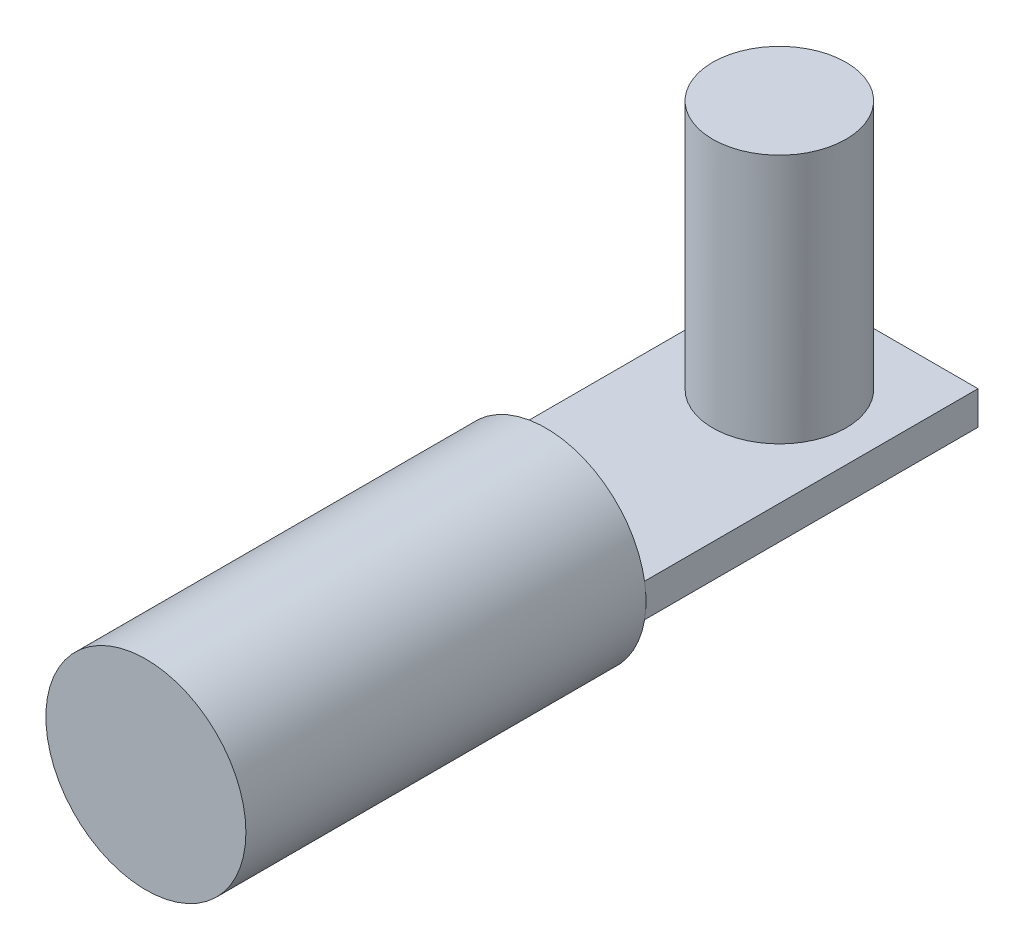
ISO-10303-21;
HEADER;
FILE_DESCRIPTION(('STEP AP214'),'2;1');
FILE_NAME('part.step','',(''),(''),'','','');
FILE_SCHEMA(('AUTOMOTIVE_DESIGN { 1 0 10303 214 1 1 1 1 }'));
ENDSEC;
DATA;
#1=APPLICATION_CONTEXT('core data for automotive mechanical design processes');
#2=APPLICATION_PROTOCOL_DEFINITION('international standard','automotive_design',2000,#1);
#3=PRODUCT_CONTEXT('',#1,'mechanical');
#4=PRODUCT('Part','Part','',(#3));
#5=PRODUCT_RELATED_PRODUCT_CATEGORY('part','',(#4));
#6=PRODUCT_DEFINITION_FORMATION('','',#4);
#7=PRODUCT_DEFINITION_CONTEXT('part definition',#1,'design');
#8=PRODUCT_DEFINITION('design','',#6,#7);
#9=PRODUCT_DEFINITION_SHAPE('','',#8);
#10=(LENGTH_UNIT() NAMED_UNIT(*) SI_UNIT(.MILLI.,.METRE.));
#11=(NAMED_UNIT(*) PLANE_ANGLE_UNIT() SI_UNIT($,.RADIAN.));
#12=(NAMED_UNIT(*) SI_UNIT($,.STERADIAN.) SOLID_ANGLE_UNIT());
#13=UNCERTAINTY_MEASURE_WITH_UNIT(LENGTH_MEASURE(1.E-05),#10,'distance_accuracy_value','');
#14=(GEOMETRIC_REPRESENTATION_CONTEXT(3) GLOBAL_UNCERTAINTY_ASSIGNED_CONTEXT((#13)) GLOBAL_UNIT_ASSIGNED_CONTEXT((#10,
#11,#12)) REPRESENTATION_CONTEXT('',''));
#15=CARTESIAN_POINT('',(0.,0.,0.));
#16=DIRECTION('',(0.,0.,1.));
#17=DIRECTION('',(1.,0.,0.));
#18=AXIS2_PLACEMENT_3D('',#15,#16,#17);
#19=CARTESIAN_POINT('',(0.,0.,0.));
#20=DIRECTION('',(0.,0.,1.));
#21=DIRECTION('',(1.,0.,0.));
#22=AXIS2_PLACEMENT_3D('',#19,#20,#21);
#23=PLANE('',#22);
#24=DIRECTION('',(0.,1.,0.));
#25=VECTOR('',#24,1.);
#26=CARTESIAN_POINT('',(-2.95782724043532,-0.501256437104602,0.));
#27=LINE('',#26,#25);
#28=CARTESIAN_POINT('',(-2.95782724043532,-0.501256437104602,0.));
#29=VERTEX_POINT('',#28);
#30=CARTESIAN_POINT('',(-2.95782724043532,0.501256437104602,0.));
#31=VERTEX_POINT('',#30);
#32=EDGE_CURVE('E55',#29,#31,#27,.T.);
#33=ORIENTED_EDGE('',*,*,#32,.F.);
#34=CARTESIAN_POINT('',(0.,0.,0.));
#35=DIRECTION('',(0.,0.,1.));
#36=DIRECTION('',(1.,0.,0.));
#37=AXIS2_PLACEMENT_3D('',#34,#35,#36);
#38=CIRCLE('',#37,3.);
#39=EDGE_CURVE('E109',#31,#29,#38,.T.);
#40=ORIENTED_EDGE('',*,*,#39,.F.);
#41=EDGE_LOOP('',(#33,#40));
#42=FACE_BOUND('',#41,.T.);
#43=ADVANCED_FACE('F34',(#42),#23,.F.);
#44=DIRECTION('',(-1.,0.,0.));
#45=VECTOR('',#44,1.);
#46=CARTESIAN_POINT('',(2.95782724043532,-0.501256437104602,0.));
#47=LINE('',#46,#45);
#48=CARTESIAN_POINT('',(2.95782724043532,-0.501256437104602,0.));
#49=VERTEX_POINT('',#48);
#50=EDGE_CURVE('E48',#49,#29,#47,.T.);
#51=ORIENTED_EDGE('',*,*,#50,.F.);
#52=EDGE_CURVE('E101',#29,#49,#38,.T.);
#53=ORIENTED_EDGE('',*,*,#52,.F.);
#54=EDGE_LOOP('',(#51,#53));
#55=FACE_BOUND('',#54,.T.);
#56=ADVANCED_FACE('F155',(#55),#23,.F.);
#57=DIRECTION('',(0.,-1.,0.));
#58=VECTOR('',#57,1.);
#59=CARTESIAN_POINT('',(2.95782724043532,-0.501256437104602,0.));
#60=LINE('',#59,#58);
#61=CARTESIAN_POINT('',(2.95782724043532,0.501256437104602,0.));
#62=VERTEX_POINT('',#61);
#63=EDGE_CURVE('E117',#62,#49,#60,.T.);
#64=ORIENTED_EDGE('',*,*,#63,.F.);
#65=EDGE_CURVE('E98',#49,#62,#38,.T.);
#66=ORIENTED_EDGE('',*,*,#65,.F.);
#67=EDGE_LOOP('',(#64,#66));
#68=FACE_BOUND('',#67,.T.);
#69=ADVANCED_FACE('F160',(#68),#23,.F.);
#70=DIRECTION('',(1.,0.,0.));
#71=VECTOR('',#70,1.);
#72=CARTESIAN_POINT('',(2.95782724043532,0.501256437104602,0.));
#73=LINE('',#72,#71);
#74=EDGE_CURVE('E121',#31,#62,#73,.T.);
#75=ORIENTED_EDGE('',*,*,#74,.F.);
#76=EDGE_CURVE('E102',#62,#31,#38,.T.);
#77=ORIENTED_EDGE('',*,*,#76,.F.);
#78=EDGE_LOOP('',(#75,#77));
#79=FACE_BOUND('',#78,.T.);
#80=ADVANCED_FACE('F156',(#79),#23,.F.);
#81=CARTESIAN_POINT('',(0.,0.,12.));
#82=DIRECTION('',(0.,0.,-1.));
#83=DIRECTION('',(-1.,0.,0.));
#84=AXIS2_PLACEMENT_3D('',#81,#82,#83);
#85=CYLINDRICAL_SURFACE('',#84,3.);
#86=CARTESIAN_POINT('',(0.,0.,12.));
#87=DIRECTION('',(0.,0.,1.));
#88=DIRECTION('',(1.,0.,0.));
#89=AXIS2_PLACEMENT_3D('',#86,#87,#88);
#90=CIRCLE('',#89,3.);
#91=CARTESIAN_POINT('',(3.,0.,12.));
#92=VERTEX_POINT('',#91);
#93=EDGE_CURVE('E42',#92,#92,#90,.T.);
#94=ORIENTED_EDGE('',*,*,#93,.F.);
#95=EDGE_LOOP('',(#94));
#96=FACE_BOUND('',#95,.T.);
#97=ORIENTED_EDGE('',*,*,#76,.T.);
#98=ORIENTED_EDGE('',*,*,#39,.T.);
#99=ORIENTED_EDGE('',*,*,#52,.T.);
#100=ORIENTED_EDGE('',*,*,#65,.T.);
#101=EDGE_LOOP('',(#97,#98,#99,#100));
#102=FACE_BOUND('',#101,.T.);
#103=ADVANCED_FACE('F36',(#96,#102),#85,.T.);
#104=CARTESIAN_POINT('',(0.,0.,12.));
#105=DIRECTION('',(0.,0.,1.));
#106=DIRECTION('',(1.,0.,0.));
#107=AXIS2_PLACEMENT_3D('',#104,#105,#106);
#108=PLANE('',#107);
#109=ORIENTED_EDGE('',*,*,#93,.T.);
#110=EDGE_LOOP('',(#109));
#111=FACE_BOUND('',#110,.T.);
#112=ADVANCED_FACE('F152',(#111),#108,.T.);
#113=CARTESIAN_POINT('',(-2.95782724043532,-0.501256437104602,-10.));
#114=DIRECTION('',(1.,0.,0.));
#115=DIRECTION('',(0.,0.,-1.));
#116=AXIS2_PLACEMENT_3D('',#113,#114,#115);
#117=PLANE('',#116);
#118=ORIENTED_EDGE('',*,*,#32,.T.);
#119=DIRECTION('',(0.,0.,1.));
#120=VECTOR('',#119,1.);
#121=CARTESIAN_POINT('',(-2.95782724043532,0.501256437104602,-10.));
#122=LINE('',#121,#120);
#123=CARTESIAN_POINT('',(-2.95782724043532,0.501256437104602,-10.));
#124=VERTEX_POINT('',#123);
#125=EDGE_CURVE('E81',#124,#31,#122,.T.);
#126=ORIENTED_EDGE('',*,*,#125,.F.);
#127=DIRECTION('',(0.,1.,0.));
#128=VECTOR('',#127,1.);
#129=CARTESIAN_POINT('',(-2.95782724043532,-0.501256437104602,-10.));
#130=LINE('',#129,#128);
#131=CARTESIAN_POINT('',(-2.95782724043532,-0.501256437104602,-10.));
#132=VERTEX_POINT('',#131);
#133=EDGE_CURVE('E87',#132,#124,#130,.T.);
#134=ORIENTED_EDGE('',*,*,#133,.F.);
#135=DIRECTION('',(0.,0.,1.));
#136=VECTOR('',#135,1.);
#137=CARTESIAN_POINT('',(-2.95782724043532,-0.501256437104602,-10.));
#138=LINE('',#137,#136);
#139=EDGE_CURVE('E125',#132,#29,#138,.T.);
#140=ORIENTED_EDGE('',*,*,#139,.T.);
#141=EDGE_LOOP('',(#118,#126,#134,#140));
#142=FACE_BOUND('',#141,.T.);
#143=ADVANCED_FACE('F97',(#142),#117,.F.);
#144=CARTESIAN_POINT('',(2.95782724043532,0.501256437104602,-10.));
#145=DIRECTION('',(0.,-1.,0.));
#146=DIRECTION('',(0.,0.,-1.));
#147=AXIS2_PLACEMENT_3D('',#144,#145,#146);
#148=PLANE('',#147);
#149=CARTESIAN_POINT('',(0.,0.501256437104602,-7.));
#150=DIRECTION('',(0.,-1.,0.));
#151=DIRECTION('',(0.,0.,-1.));
#152=AXIS2_PLACEMENT_3D('',#149,#150,#151);
#153=CIRCLE('',#152,2.);
#154=CARTESIAN_POINT('',(0.,0.501256437104602,-9.));
#155=VERTEX_POINT('',#154);
#156=EDGE_CURVE('E11',#155,#155,#153,.F.);
#157=ORIENTED_EDGE('',*,*,#156,.F.);
#158=EDGE_LOOP('',(#157));
#159=FACE_BOUND('',#158,.T.);
#160=ORIENTED_EDGE('',*,*,#74,.T.);
#161=DIRECTION('',(0.,0.,1.));
#162=VECTOR('',#161,1.);
#163=CARTESIAN_POINT('',(2.95782724043532,0.501256437104602,-10.));
#164=LINE('',#163,#162);
#165=CARTESIAN_POINT('',(2.95782724043532,0.501256437104602,-10.));
#166=VERTEX_POINT('',#165);
#167=EDGE_CURVE('E83',#166,#62,#164,.T.);
#168=ORIENTED_EDGE('',*,*,#167,.F.);
#169=DIRECTION('',(1.,0.,0.));
#170=VECTOR('',#169,1.);
#171=CARTESIAN_POINT('',(2.95782724043532,0.501256437104602,-10.));
#172=LINE('',#171,#170);
#173=EDGE_CURVE('E76',#124,#166,#172,.T.);
#174=ORIENTED_EDGE('',*,*,#173,.F.);
#175=ORIENTED_EDGE('',*,*,#125,.T.);
#176=EDGE_LOOP('',(#160,#168,#174,#175));
#177=FACE_BOUND('',#176,.T.);
#178=ADVANCED_FACE('F79',(#159,#177),#148,.F.);
#179=CARTESIAN_POINT('',(2.95782724043532,-0.501256437104602,-10.));
#180=DIRECTION('',(-1.,0.,0.));
#181=DIRECTION('',(0.,0.,1.));
#182=AXIS2_PLACEMENT_3D('',#179,#180,#181);
#183=PLANE('',#182);
#184=ORIENTED_EDGE('',*,*,#63,.T.);
#185=DIRECTION('',(0.,0.,1.));
#186=VECTOR('',#185,1.);
#187=CARTESIAN_POINT('',(2.95782724043532,-0.501256437104602,-10.));
#188=LINE('',#187,#186);
#189=CARTESIAN_POINT('',(2.95782724043532,-0.501256437104602,-10.));
#190=VERTEX_POINT('',#189);
#191=EDGE_CURVE('E103',#190,#49,#188,.T.);
#192=ORIENTED_EDGE('',*,*,#191,.F.);
#193=DIRECTION('',(0.,-1.,0.));
#194=VECTOR('',#193,1.);
#195=CARTESIAN_POINT('',(2.95782724043532,-0.501256437104602,-10.));
#196=LINE('',#195,#194);
#197=EDGE_CURVE('E86',#166,#190,#196,.T.);
#198=ORIENTED_EDGE('',*,*,#197,.F.);
#199=ORIENTED_EDGE('',*,*,#167,.T.);
#200=EDGE_LOOP('',(#184,#192,#198,#199));
#201=FACE_BOUND('',#200,.T.);
#202=ADVANCED_FACE('F119',(#201),#183,.F.);
#203=CARTESIAN_POINT('',(2.95782724043532,-0.501256437104602,-10.));
#204=DIRECTION('',(0.,1.,0.));
#205=DIRECTION('',(0.,0.,1.));
#206=AXIS2_PLACEMENT_3D('',#203,#204,#205);
#207=PLANE('',#206);
#208=ORIENTED_EDGE('',*,*,#50,.T.);
#209=ORIENTED_EDGE('',*,*,#139,.F.);
#210=DIRECTION('',(-1.,0.,0.));
#211=VECTOR('',#210,1.);
#212=CARTESIAN_POINT('',(2.95782724043532,-0.501256437104602,-10.));
#213=LINE('',#212,#211);
#214=EDGE_CURVE('E92',#190,#132,#213,.T.);
#215=ORIENTED_EDGE('',*,*,#214,.F.);
#216=ORIENTED_EDGE('',*,*,#191,.T.);
#217=EDGE_LOOP('',(#208,#209,#215,#216));
#218=FACE_BOUND('',#217,.T.);
#219=ADVANCED_FACE('F124',(#218),#207,.F.);
#220=CARTESIAN_POINT('',(0.,0.,-10.));
#221=DIRECTION('',(0.,0.,1.));
#222=DIRECTION('',(1.,0.,0.));
#223=AXIS2_PLACEMENT_3D('',#220,#221,#222);
#224=PLANE('',#223);
#225=ORIENTED_EDGE('',*,*,#133,.T.);
#226=ORIENTED_EDGE('',*,*,#173,.T.);
#227=ORIENTED_EDGE('',*,*,#197,.T.);
#228=ORIENTED_EDGE('',*,*,#214,.T.);
#229=EDGE_LOOP('',(#225,#226,#227,#228));
#230=FACE_BOUND('',#229,.T.);
#231=ADVANCED_FACE('F90',(#230),#224,.F.);
#232=CARTESIAN_POINT('',(0.,8.0012564371046,-7.));
#233=DIRECTION('',(0.,-1.,0.));
#234=DIRECTION('',(0.,0.,-1.));
#235=AXIS2_PLACEMENT_3D('',#232,#233,#234);
#236=CYLINDRICAL_SURFACE('',#235,2.);
#237=CARTESIAN_POINT('',(0.,8.0012564371046,-7.));
#238=DIRECTION('',(0.,1.,0.));
#239=DIRECTION('',(0.,0.,1.));
#240=AXIS2_PLACEMENT_3D('',#237,#238,#239);
#241=CIRCLE('',#240,2.);
#242=CARTESIAN_POINT('',(0.,8.0012564371046,-5.));
#243=VERTEX_POINT('',#242);
#244=EDGE_CURVE('E131',#243,#243,#241,.T.);
#245=ORIENTED_EDGE('',*,*,#244,.F.);
#246=EDGE_LOOP('',(#245));
#247=FACE_BOUND('',#246,.T.);
#248=ORIENTED_EDGE('',*,*,#156,.T.);
#249=EDGE_LOOP('',(#248));
#250=FACE_BOUND('',#249,.T.);
#251=ADVANCED_FACE('F139',(#247,#250),#236,.T.);
#252=CARTESIAN_POINT('',(0.,8.0012564371046,-7.));
#253=DIRECTION('',(0.,1.,0.));
#254=DIRECTION('',(0.,0.,1.));
#255=AXIS2_PLACEMENT_3D('',#252,#253,#254);
#256=PLANE('',#255);
#257=ORIENTED_EDGE('',*,*,#244,.T.);
#258=EDGE_LOOP('',(#257));
#259=FACE_BOUND('',#258,.T.);
#260=ADVANCED_FACE('F137',(#259),#256,.T.);
#261=CLOSED_SHELL('',(#43,#56,#69,#80,#103,#112,#143,#178,#202,#219,#231,#251,#260));
#262=MANIFOLD_SOLID_BREP('B2',#261);
#263=ADVANCED_BREP_SHAPE_REPRESENTATION('',(#18,#262),#14);
#264=SHAPE_DEFINITION_REPRESENTATION(#9,#263);
ENDSEC;
END-ISO-10303-21;
